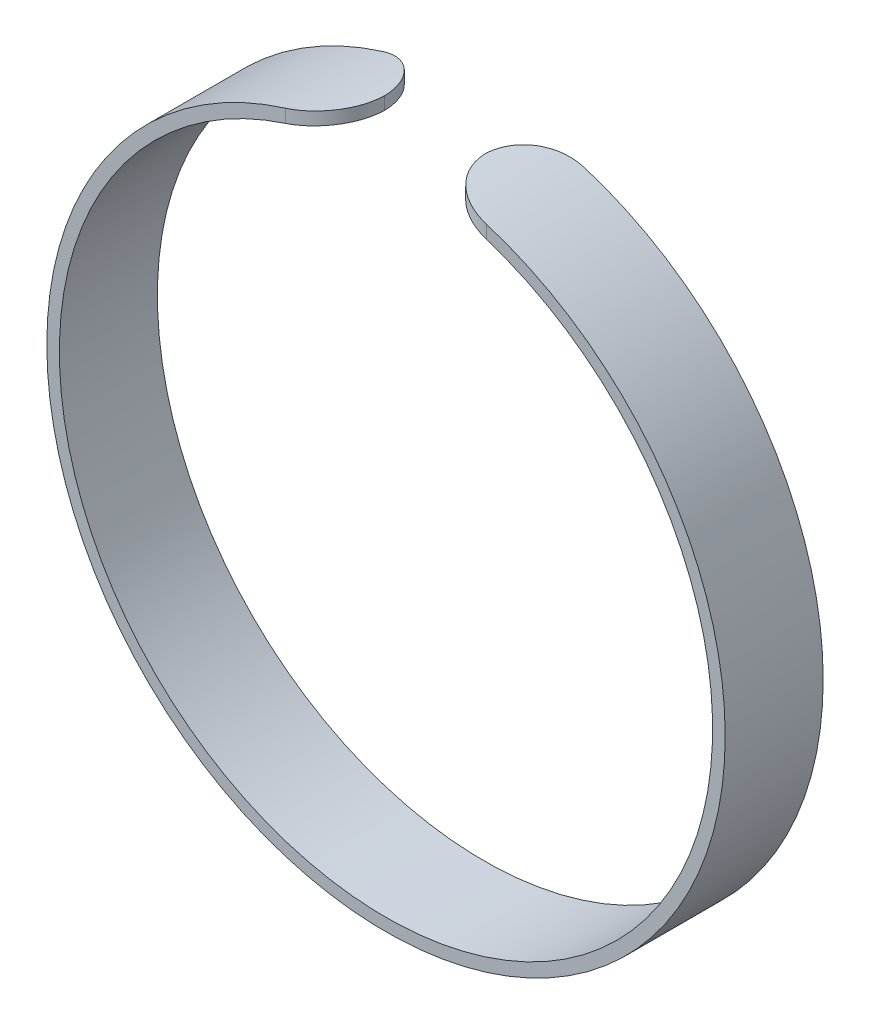
ISO-10303-21;
HEADER;
FILE_DESCRIPTION(('STEP AP214'),'2;1');
FILE_NAME('part.step','',(''),(''),'','','');
FILE_SCHEMA(('AUTOMOTIVE_DESIGN { 1 0 10303 214 1 1 1 1 }'));
ENDSEC;
DATA;
#1=APPLICATION_CONTEXT('core data for automotive mechanical design processes');
#2=APPLICATION_PROTOCOL_DEFINITION('international standard','automotive_design',2000,#1);
#3=PRODUCT_CONTEXT('',#1,'mechanical');
#4=PRODUCT('Part','Part','',(#3));
#5=PRODUCT_RELATED_PRODUCT_CATEGORY('part','',(#4));
#6=PRODUCT_DEFINITION_FORMATION('','',#4);
#7=PRODUCT_DEFINITION_CONTEXT('part definition',#1,'design');
#8=PRODUCT_DEFINITION('design','',#6,#7);
#9=PRODUCT_DEFINITION_SHAPE('','',#8);
#10=(LENGTH_UNIT() NAMED_UNIT(*) SI_UNIT(.MILLI.,.METRE.));
#11=(NAMED_UNIT(*) PLANE_ANGLE_UNIT() SI_UNIT($,.RADIAN.));
#12=(NAMED_UNIT(*) SI_UNIT($,.STERADIAN.) SOLID_ANGLE_UNIT());
#13=UNCERTAINTY_MEASURE_WITH_UNIT(LENGTH_MEASURE(1.E-05),#10,'distance_accuracy_value','');
#14=(GEOMETRIC_REPRESENTATION_CONTEXT(3) GLOBAL_UNCERTAINTY_ASSIGNED_CONTEXT((#13)) GLOBAL_UNIT_ASSIGNED_CONTEXT((#10,
#11,#12)) REPRESENTATION_CONTEXT('',''));
#15=CARTESIAN_POINT('',(0.,0.,0.));
#16=DIRECTION('',(0.,0.,1.));
#17=DIRECTION('',(1.,0.,0.));
#18=AXIS2_PLACEMENT_3D('',#15,#16,#17);
#19=CARTESIAN_POINT('',(0.,0.,7.8));
#20=DIRECTION('',(0.,0.,-1.));
#21=DIRECTION('',(-1.,0.,0.));
#22=AXIS2_PLACEMENT_3D('',#19,#20,#21);
#23=CYLINDRICAL_SURFACE('',#22,26.);
#24=CARTESIAN_POINT('',(7.99999999999999,24.738633753706,7.8));
#25=CARTESIAN_POINT('',(7.88780128889304,24.7749247791275,7.80001059040212));
#26=CARTESIAN_POINT('',(7.77534163963829,24.8104410799334,7.79527944188164));
#27=CARTESIAN_POINT('',(7.55066863119694,24.8797330909779,7.77627861395891));
#28=CARTESIAN_POINT('',(7.43845532665588,24.9135084463271,7.76200699796236));
#29=CARTESIAN_POINT('',(7.21499483830451,24.9791402939498,7.72385399238697));
#30=CARTESIAN_POINT('',(7.10374855274676,25.0109951376633,7.69996447816594));
#31=CARTESIAN_POINT('',(6.88316404283017,25.0725977450881,7.6426112626765));
#32=CARTESIAN_POINT('',(6.77382566352756,25.1023456805103,7.60914834275349));
#33=CARTESIAN_POINT('',(6.5577281441054,25.1596645570077,7.53269459864832));
#34=CARTESIAN_POINT('',(6.45097349713466,25.1872318717162,7.48968833774168));
#35=CARTESIAN_POINT('',(6.24106186273427,25.2400646890394,7.39436066958367));
#36=CARTESIAN_POINT('',(6.13790623821223,25.2653293253728,7.34203577829747));
#37=CARTESIAN_POINT('',(5.93622566779991,25.313473929809,7.22844194763067));
#38=CARTESIAN_POINT('',(5.8376953662074,25.3363566952639,7.16718370771881));
#39=CARTESIAN_POINT('',(5.64594912693324,25.3797739650946,7.03603769829408));
#40=CARTESIAN_POINT('',(5.55273510141379,25.400307627181,6.9661468520569));
#41=CARTESIAN_POINT('',(5.37543012520367,25.4384100362278,6.82065414007161));
#42=CARTESIAN_POINT('',(5.29114047544874,25.45605380485,6.74531391915572));
#43=CARTESIAN_POINT('',(5.12900306791501,25.4892169132343,6.58750405498525));
#44=CARTESIAN_POINT('',(5.05115770131488,25.504735465811,6.50503178835714));
#45=CARTESIAN_POINT('',(4.90260075509351,25.5337078156146,6.3335713839282));
#46=CARTESIAN_POINT('',(4.83188851050611,25.5471618053659,6.24458385483247));
#47=CARTESIAN_POINT('',(4.69815475223753,25.5720936216651,6.06069613889817));
#48=CARTESIAN_POINT('',(4.63513594682483,25.5835707528939,5.96579388759686));
#49=CARTESIAN_POINT('',(4.51862852993752,25.6044024197479,5.77293361168757));
#50=CARTESIAN_POINT('',(4.46496199735855,25.6137978003377,5.67508742304298));
#51=CARTESIAN_POINT('',(4.36594150400212,25.6308618565737,5.47513163966176));
#52=CARTESIAN_POINT('',(4.32058748151032,25.6385305450393,5.3730220765845));
#53=CARTESIAN_POINT('',(4.23857501593894,25.6522165477553,5.16533414213465));
#54=CARTESIAN_POINT('',(4.20191114725008,25.6582348927511,5.05975798222941));
#55=CARTESIAN_POINT('',(4.13753517442944,25.6686940535128,4.84586933780654));
#56=CARTESIAN_POINT('',(4.10982091553704,25.6731352490282,4.73755751872374));
#57=CARTESIAN_POINT('',(4.05789100346867,25.6814024084558,4.49216657746712));
#58=CARTESIAN_POINT('',(4.03619106220021,25.6848118742625,4.35453378037896));
#59=CARTESIAN_POINT('',(4.00723884463647,25.6893376163361,4.0779277299844));
#60=CARTESIAN_POINT('',(3.99996513436462,25.690457294764,3.93895677405664));
#61=CARTESIAN_POINT('',(3.99999999999999,25.6904651573303,3.8));
#62=B_SPLINE_CURVE_WITH_KNOTS('',3,(#24,#25,#26,#27,#28,#29,#30,#31,#32,#33,#34,#35,#36,#37,#38,
#39,#40,#41,#42,#43,#44,#45,#46,#47,#48,#49,#50,#51,#52,#53,#54,#55,#56,#57,#58,#59,#60,#61),
.UNSPECIFIED.,.F.,.F.,(4,2,2,2,2,2,2,2,2,2,2,2,2,2,2,2,2,2,4),(0.,0.35368294352253,
0.707437702020362,1.06149192113039,1.41551725190463,1.770119461602,2.12485452881238,
2.47916816719629,2.83360845193397,3.17645299296719,3.51942418298338,3.86236337082536,
4.20542293520076,4.54099813865348,4.8765708506035,5.21193349598853,5.54721533718753,
5.96454312484224,6.38125039595386),.UNSPECIFIED.);
#63=CARTESIAN_POINT('',(7.99999999999999,24.738633753706,7.8));
#64=VERTEX_POINT('',#63);
#65=CARTESIAN_POINT('',(4.00125019537355,25.6902704710173,3.89999999999999));
#66=VERTEX_POINT('',#65);
#67=EDGE_CURVE('E95',#64,#66,#62,.T.);
#68=ORIENTED_EDGE('',*,*,#67,.T.);
#69=CARTESIAN_POINT('',(4.,25.6904651573302,4.));
#70=CARTESIAN_POINT('',(3.99998729515075,25.6904616899582,3.88878535682253));
#71=CARTESIAN_POINT('',(4.00463772566692,25.6897428934487,3.77757243666818));
#72=CARTESIAN_POINT('',(4.02317320520207,25.6868495556298,3.55594316834291));
#73=CARTESIAN_POINT('',(4.03705779737096,25.6846750863383,3.44552678103757));
#74=CARTESIAN_POINT('',(4.07395422630359,25.6788478067381,3.22636602977801));
#75=CARTESIAN_POINT('',(4.09695826968066,25.6751962586712,3.11762032029352));
#76=CARTESIAN_POINT('',(4.15191334508979,25.666366992627,2.90247848122693));
#77=CARTESIAN_POINT('',(4.18386426537028,25.661189293712,2.79608232231551));
#78=CARTESIAN_POINT('',(4.25647953274379,25.6492443096806,2.58636192647434));
#79=CARTESIAN_POINT('',(4.29714651264747,25.6424765442022,2.48303862850903));
#80=CARTESIAN_POINT('',(4.38688967642551,25.6272758978351,2.28019237776466));
#81=CARTESIAN_POINT('',(4.43596895665909,25.6188424036581,2.18067084087276));
#82=CARTESIAN_POINT('',(4.54211563138057,25.600236045029,1.98622285342621));
#83=CARTESIAN_POINT('',(4.59917875525639,25.5900641098406,1.89129398251943));
#84=CARTESIAN_POINT('',(4.72088840846814,25.5678907756342,1.70660455288267));
#85=CARTESIAN_POINT('',(4.78553772492775,25.5558887037463,1.6168459118355));
#86=CARTESIAN_POINT('',(4.9219430610431,25.52996860323,1.44309316280466));
#87=CARTESIAN_POINT('',(4.99370406593669,25.5160492278834,1.35910316942855));
#88=CARTESIAN_POINT('',(5.14375355046704,25.4862247712014,1.19749745116894));
#89=CARTESIAN_POINT('',(5.22204442659367,25.470318959761,1.11988408746347));
#90=CARTESIAN_POINT('',(5.38449552067398,25.436471455213,0.971597598705601));
#91=CARTESIAN_POINT('',(5.4686538131487,25.4185304287902,0.900922215016373));
#92=CARTESIAN_POINT('',(5.642202408035,25.380572654344,0.766915979974021));
#93=CARTESIAN_POINT('',(5.73159459296637,25.3605551574356,0.703587795974791));
#94=CARTESIAN_POINT('',(6.00814584817664,25.2969957556274,0.524232928340125));
#95=CARTESIAN_POINT('',(6.20239849867831,25.2502084547327,0.420000999656298));
#96=CARTESIAN_POINT('',(6.60341878334278,25.1483137844103,0.245341762686058));
#97=CARTESIAN_POINT('',(6.81018789357836,25.0932054325268,0.174918450247949));
#98=CARTESIAN_POINT('',(7.18146767591195,24.9890884241917,0.0811115351601627));
#99=CARTESIAN_POINT('',(7.34465709493559,24.941629364865,0.0506062363593495));
#100=CARTESIAN_POINT('',(7.67208063803784,24.842882145666,0.0100490101190389));
#101=CARTESIAN_POINT('',(7.83631222245,24.7916013494489,-4.12476647415887E-05));
#102=CARTESIAN_POINT('',(7.99999999999999,24.738633753706,0.));
#103=B_SPLINE_CURVE_WITH_KNOTS('',3,(#69,#70,#71,#72,#73,#74,#75,#76,#77,#78,#79,#80,#81,#82,
#83,#84,#85,#86,#87,#88,#89,#90,#91,#92,#93,#94,#95,#96,#97,#98,#99,#100,#101,#102),
.UNSPECIFIED.,.F.,.F.,(4,2,2,2,2,2,2,2,2,2,2,2,2,2,2,2,4),(0.,0.333541994140305,
0.667067487880818,1.00030856658266,1.33354548309996,1.66688320082325,2.00034387641227,
2.33362685875552,2.66703267300283,3.00067387788298,3.33443807386468,3.66809325113834,
4.00186918323618,4.67461000074208,5.3474303100804,5.86420557592073,6.38000966445057),.UNSPECIFIED.);
#104=CARTESIAN_POINT('',(7.99999999999999,24.738633753706,0.));
#105=VERTEX_POINT('',#104);
#106=EDGE_CURVE('E90',#66,#105,#103,.T.);
#107=ORIENTED_EDGE('',*,*,#106,.T.);
#108=CARTESIAN_POINT('',(0.,0.,0.));
#109=DIRECTION('',(0.,0.,-1.));
#110=DIRECTION('',(1.,0.,0.));
#111=AXIS2_PLACEMENT_3D('',#108,#109,#110);
#112=CIRCLE('',#111,26.);
#113=CARTESIAN_POINT('',(-8.00000000000001,24.738633753706,0.));
#114=VERTEX_POINT('',#113);
#115=EDGE_CURVE('E92',#105,#114,#112,.T.);
#116=ORIENTED_EDGE('',*,*,#115,.T.);
#117=CARTESIAN_POINT('',(-8.00000000000001,24.738633753706,0.));
#118=CARTESIAN_POINT('',(-7.88780128889307,24.7749247791275,-1.05904021225132E-05));
#119=CARTESIAN_POINT('',(-7.77534163963831,24.8104410799334,0.00472055811835463));
#120=CARTESIAN_POINT('',(-7.55066863119696,24.8797330909779,0.0237213860410892));
#121=CARTESIAN_POINT('',(-7.43845532665591,24.9135084463271,0.0379930020376405));
#122=CARTESIAN_POINT('',(-7.21499483830453,24.9791402939498,0.0761460076130332));
#123=CARTESIAN_POINT('',(-7.10374855274678,25.0109951376633,0.100035521834055));
#124=CARTESIAN_POINT('',(-6.88316404283019,25.0725977450881,0.1573887373235));
#125=CARTESIAN_POINT('',(-6.77382566352758,25.1023456805103,0.19085165724651));
#126=CARTESIAN_POINT('',(-6.55772814410542,25.1596645570077,0.267305401351685));
#127=CARTESIAN_POINT('',(-6.45097349713468,25.1872318717162,0.310311662258317));
#128=CARTESIAN_POINT('',(-6.24106186273428,25.2400646890394,0.405639330416335));
#129=CARTESIAN_POINT('',(-6.13790623821224,25.2653293253728,0.457964221702536));
#130=CARTESIAN_POINT('',(-5.93622566779992,25.313473929809,0.57155805236933));
#131=CARTESIAN_POINT('',(-5.83769536620741,25.3363566952639,0.63281629228119));
#132=CARTESIAN_POINT('',(-5.64594912693325,25.3797739650946,0.763962301705925));
#133=CARTESIAN_POINT('',(-5.5527351014138,25.400307627181,0.833853147943102));
#134=CARTESIAN_POINT('',(-5.37543012520368,25.4384100362278,0.979345859928391));
#135=CARTESIAN_POINT('',(-5.29114047544875,25.45605380485,1.05468608084429));
#136=CARTESIAN_POINT('',(-5.12900306791502,25.4892169132343,1.21249594501475));
#137=CARTESIAN_POINT('',(-5.05115770131488,25.504735465811,1.29496821164287));
#138=CARTESIAN_POINT('',(-4.90260075509352,25.5337078156146,1.46642861607181));
#139=CARTESIAN_POINT('',(-4.83188851050611,25.5471618053659,1.55541614516754));
#140=CARTESIAN_POINT('',(-4.69815475223753,25.5720936216651,1.73930386110184));
#141=CARTESIAN_POINT('',(-4.63513594682483,25.5835707528939,1.83420611240315));
#142=CARTESIAN_POINT('',(-4.51862852993752,25.6044024197479,2.02706638831244));
#143=CARTESIAN_POINT('',(-4.46496199735856,25.6137978003377,2.12491257695703));
#144=CARTESIAN_POINT('',(-4.36594150400213,25.6308618565737,2.32486836033825));
#145=CARTESIAN_POINT('',(-4.32058748151032,25.6385305450393,2.42697792341551));
#146=CARTESIAN_POINT('',(-4.23857501593895,25.6522165477553,2.63466585786537));
#147=CARTESIAN_POINT('',(-4.20191114725009,25.6582348927511,2.7402420177706));
#148=CARTESIAN_POINT('',(-4.13753517442945,25.6686940535128,2.95413066219348));
#149=CARTESIAN_POINT('',(-4.10982091553704,25.6731352490282,3.06244248127627));
#150=CARTESIAN_POINT('',(-4.05789100346868,25.6814024084558,3.3078334225329));
#151=CARTESIAN_POINT('',(-4.03619106220022,25.6848118742625,3.44546621962106));
#152=CARTESIAN_POINT('',(-4.00723884463648,25.6893376163361,3.72207227001561));
#153=CARTESIAN_POINT('',(-3.99996513436463,25.690457294764,3.86104322594336));
#154=CARTESIAN_POINT('',(-4.00000000000001,25.6904651573303,4.));
#155=B_SPLINE_CURVE_WITH_KNOTS('',3,(#117,#118,#119,#120,#121,#122,#123,#124,#125,#126,#127,
#128,#129,#130,#131,#132,#133,#134,#135,#136,#137,#138,#139,#140,#141,#142,#143,#144,#145,#146,
#147,#148,#149,#150,#151,#152,#153,#154),.UNSPECIFIED.,.F.,.F.,(4,2,2,2,2,2,2,2,2,2,2,2,2,2,2,2,
2,2,4),(0.,0.353682943522533,0.707437702020366,1.0614919211304,1.41551725190464,
1.77011946160201,2.1248545288124,2.47916816719631,2.83360845193399,3.17645299296721,
3.5194241829834,3.86236337082539,4.20542293520078,4.54099813865351,4.87657085060353,
5.21193349598856,5.54721533718755,5.96454312484226,6.38125039595387),.UNSPECIFIED.);
#156=CARTESIAN_POINT('',(-4.00125019537356,25.6902704710173,3.90000000000012));
#157=VERTEX_POINT('',#156);
#158=EDGE_CURVE('E161',#114,#157,#155,.T.);
#159=ORIENTED_EDGE('',*,*,#158,.T.);
#160=CARTESIAN_POINT('',(-4.,25.6904651573303,3.8));
#161=CARTESIAN_POINT('',(-3.99998729515076,25.6904616899582,3.91121464317747));
#162=CARTESIAN_POINT('',(-4.00463772566693,25.6897428934487,4.02242756333182));
#163=CARTESIAN_POINT('',(-4.02317320520209,25.6868495556298,4.24405683165709));
#164=CARTESIAN_POINT('',(-4.03705779737097,25.6846750863383,4.35447321896243));
#165=CARTESIAN_POINT('',(-4.0739542263036,25.6788478067381,4.57363397022199));
#166=CARTESIAN_POINT('',(-4.09695826968067,25.6751962586712,4.68237967970648));
#167=CARTESIAN_POINT('',(-4.1519133450898,25.666366992627,4.89752151877307));
#168=CARTESIAN_POINT('',(-4.18386426537029,25.661189293712,5.00391767768449));
#169=CARTESIAN_POINT('',(-4.2564795327438,25.6492443096806,5.21363807352566));
#170=CARTESIAN_POINT('',(-4.29714651264748,25.6424765442022,5.31696137149096));
#171=CARTESIAN_POINT('',(-4.38688967642553,25.6272758978351,5.51980762223534));
#172=CARTESIAN_POINT('',(-4.4359689566591,25.6188424036581,5.61932915912724));
#173=CARTESIAN_POINT('',(-4.54211563138058,25.600236045029,5.81377714657379));
#174=CARTESIAN_POINT('',(-4.5991787552564,25.5900641098406,5.90870601748057));
#175=CARTESIAN_POINT('',(-4.72088840846815,25.5678907756341,6.09339544711733));
#176=CARTESIAN_POINT('',(-4.78553772492776,25.5558887037463,6.1831540881645));
#177=CARTESIAN_POINT('',(-4.92194306104311,25.52996860323,6.35690683719534));
#178=CARTESIAN_POINT('',(-4.9937040659367,25.5160492278834,6.44089683057144));
#179=CARTESIAN_POINT('',(-5.14375355046705,25.4862247712014,6.60250254883106));
#180=CARTESIAN_POINT('',(-5.22204442659368,25.470318959761,6.68011591253652));
#181=CARTESIAN_POINT('',(-5.38449552067399,25.436471455213,6.82840240129439));
#182=CARTESIAN_POINT('',(-5.46865381314871,25.4185304287902,6.89907778498362));
#183=CARTESIAN_POINT('',(-5.64220240803501,25.380572654344,7.03308402002597));
#184=CARTESIAN_POINT('',(-5.73159459296638,25.3605551574356,7.0964122040252));
#185=CARTESIAN_POINT('',(-6.00814584817665,25.2969957556273,7.27576707165987));
#186=CARTESIAN_POINT('',(-6.20239849867832,25.2502084547327,7.3799990003437));
#187=CARTESIAN_POINT('',(-6.60341878334279,25.1483137844103,7.55465823731394));
#188=CARTESIAN_POINT('',(-6.81018789357837,25.0932054325268,7.62508154975205));
#189=CARTESIAN_POINT('',(-7.18146767591196,24.9890884241917,7.71888846483983));
#190=CARTESIAN_POINT('',(-7.3446570949356,24.9416293648649,7.74939376364065));
#191=CARTESIAN_POINT('',(-7.67208063803786,24.842882145666,7.78995098988096));
#192=CARTESIAN_POINT('',(-7.83631222245003,24.7916013494489,7.80004124766474));
#193=CARTESIAN_POINT('',(-8.00000000000001,24.738633753706,7.8));
#194=B_SPLINE_CURVE_WITH_KNOTS('',3,(#160,#161,#162,#163,#164,#165,#166,#167,#168,#169,#170,
#171,#172,#173,#174,#175,#176,#177,#178,#179,#180,#181,#182,#183,#184,#185,#186,#187,#188,#189,
#190,#191,#192,#193),.UNSPECIFIED.,.F.,.F.,(4,2,2,2,2,2,2,2,2,2,2,2,2,2,2,2,4),(0.,
0.333541994140304,0.667067487880816,1.00030856658265,1.33354548309996,1.66688320082325,
2.00034387641226,2.33362685875552,2.66703267300283,3.00067387788298,3.33443807386467,
3.66809325113833,4.00186918323618,4.67461000074208,5.3474303100804,5.86420557592073,
6.38000966445058),.UNSPECIFIED.);
#195=CARTESIAN_POINT('',(-8.00000000000001,24.738633753706,7.8));
#196=VERTEX_POINT('',#195);
#197=EDGE_CURVE('E169',#157,#196,#194,.T.);
#198=ORIENTED_EDGE('',*,*,#197,.T.);
#199=CARTESIAN_POINT('',(0.,0.,7.8));
#200=DIRECTION('',(0.,0.,-1.));
#201=DIRECTION('',(1.,0.,0.));
#202=AXIS2_PLACEMENT_3D('',#199,#200,#201);
#203=CIRCLE('',#202,26.);
#204=EDGE_CURVE('E175',#64,#196,#203,.T.);
#205=ORIENTED_EDGE('',*,*,#204,.F.);
#206=EDGE_LOOP('',(#68,#107,#116,#159,#198,#205));
#207=FACE_BOUND('',#206,.T.);
#208=ADVANCED_FACE('F35',(#207),#23,.F.);
#209=CARTESIAN_POINT('',(0.,0.,7.8));
#210=DIRECTION('',(0.,0.,-1.));
#211=DIRECTION('',(-1.,0.,0.));
#212=AXIS2_PLACEMENT_3D('',#209,#210,#211);
#213=CYLINDRICAL_SURFACE('',#212,27.);
#214=CARTESIAN_POINT('',(0.,0.,0.));
#215=DIRECTION('',(0.,0.,1.));
#216=DIRECTION('',(1.,0.,0.));
#217=AXIS2_PLACEMENT_3D('',#214,#215,#216);
#218=CIRCLE('',#217,27.);
#219=CARTESIAN_POINT('',(-8.00000000000001,25.7875939164553,0.));
#220=VERTEX_POINT('',#219);
#221=CARTESIAN_POINT('',(7.99999999999999,25.7875939164553,0.));
#222=VERTEX_POINT('',#221);
#223=EDGE_CURVE('E109',#220,#222,#218,.T.);
#224=ORIENTED_EDGE('',*,*,#223,.T.);
#225=CARTESIAN_POINT('',(7.99999999999999,25.7875939164553,0.));
#226=CARTESIAN_POINT('',(7.88777673581484,25.8224163227939,-1.07056624829766E-05));
#227=CARTESIAN_POINT('',(7.77531327031235,25.8564948960574,0.00472259651644716));
#228=CARTESIAN_POINT('',(7.55067642212848,25.9229801873043,0.0237210875305384));
#229=CARTESIAN_POINT('',(7.43850309677172,25.955386595792,0.037988034149566));
#230=CARTESIAN_POINT('',(7.21517835090967,26.0183531203165,0.0761114865411439));
#231=CARTESIAN_POINT('',(7.10402772722682,26.048911885585,0.0999749128459947));
#232=CARTESIAN_POINT('',(6.88367128347212,26.1080078507981,0.157244919221112));
#233=CARTESIAN_POINT('',(6.77446531540123,26.1365452050798,0.190650769734092));
#234=CARTESIAN_POINT('',(6.55867388690396,26.1915294685546,0.266945534099979));
#235=CARTESIAN_POINT('',(6.45209268631427,26.217973116382,0.309848862392007));
#236=CARTESIAN_POINT('',(6.24254738711562,26.2686548321594,0.404919792116907));
#237=CARTESIAN_POINT('',(6.13958465688199,26.2928920711197,0.457090854062565));
#238=CARTESIAN_POINT('',(5.93829139008893,26.3390840479952,0.570323993027257));
#239=CARTESIAN_POINT('',(5.83995571992083,26.3610413497361,0.631375893698308));
#240=CARTESIAN_POINT('',(5.64859270292504,26.4027080918956,0.76205126795619));
#241=CARTESIAN_POINT('',(5.55556727135004,26.4224167238105,0.831677805940187));
#242=CARTESIAN_POINT('',(5.37838890695321,26.4590413669387,0.976778579222938));
#243=CARTESIAN_POINT('',(5.29405278997933,26.4760237784653,1.05201247189785));
#244=CARTESIAN_POINT('',(5.13182704432345,26.5079457753882,1.209591900288));
#245=CARTESIAN_POINT('',(5.05393981047716,26.5228846032174,1.29194005494049));
#246=CARTESIAN_POINT('',(4.905293639425,26.5507780656627,1.46314436054602));
#247=CARTESIAN_POINT('',(4.83453399576992,26.5637328969886,1.55199986501418));
#248=CARTESIAN_POINT('',(4.70070705971659,26.5877410055563,1.73558124400363));
#249=CARTESIAN_POINT('',(4.63764247905698,26.5987936130149,1.83030917033255));
#250=CARTESIAN_POINT('',(4.4632249083076,26.6288078392456,2.1183006039333));
#251=CARTESIAN_POINT('',(4.36347266236,26.6452057809642,2.3190431710199));
#252=CARTESIAN_POINT('',(4.19887420898984,26.6716416123113,2.73454953721263));
#253=CARTESIAN_POINT('',(4.1340023082623,26.6816841843537,2.94930288468016));
#254=CARTESIAN_POINT('',(4.05841973547492,26.6932589658265,3.30464548947795));
#255=CARTESIAN_POINT('',(4.0365239705433,26.696569835127,3.44288978516845));
#256=CARTESIAN_POINT('',(4.0073160752127,26.7009641693407,3.72073784430977));
#257=CARTESIAN_POINT('',(3.99998238244491,26.7020509276154,3.86033928970323));
#258=CARTESIAN_POINT('',(4.,26.7020598456374,4.));
#259=B_SPLINE_CURVE_WITH_KNOTS('',3,(#225,#226,#227,#228,#229,#230,#231,#232,#233,#234,#235,
#236,#237,#238,#239,#240,#241,#242,#243,#244,#245,#246,#247,#248,#249,#250,#251,#252,#253,#254,
#255,#256,#257,#258),.UNSPECIFIED.,.F.,.F.,(4,2,2,2,2,2,2,2,2,2,2,2,2,2,2,2,4),(0.,
0.352420804401392,0.704906604995578,1.05764705901883,1.4103605518091,1.76361307781188,
2.11699778438003,2.46998069964741,2.82309013175606,3.16552723137753,3.50809093220943,
3.85062064645373,4.19327072160773,4.86409754697814,5.53442955346872,5.95372065588963,
6.37239044073071),.UNSPECIFIED.);
#260=CARTESIAN_POINT('',(4.00125019537356,26.7018725349745,3.9000000000001));
#261=VERTEX_POINT('',#260);
#262=EDGE_CURVE('E53',#222,#261,#259,.T.);
#263=ORIENTED_EDGE('',*,*,#262,.T.);
#264=CARTESIAN_POINT('',(4.,26.7020598456374,3.8));
#265=CARTESIAN_POINT('',(3.99998733789281,26.7020564946756,3.91130891084654));
#266=CARTESIAN_POINT('',(4.00464559390361,26.7013637654338,4.0226160976723));
#267=CARTESIAN_POINT('',(4.02321259103469,26.6985753074059,4.24443328825431));
#268=CARTESIAN_POINT('',(4.03712087551172,26.6964796478778,4.35494333109071));
#269=CARTESIAN_POINT('',(4.07408096047666,26.6908634664914,4.57429085597553));
#270=CARTESIAN_POINT('',(4.09712501858983,26.6873441511,4.68312967343134));
#271=CARTESIAN_POINT('',(4.15217702100288,26.6788344254441,4.89845583483963));
#272=CARTESIAN_POINT('',(4.18418485352564,26.6738440335237,5.00494320809645));
#273=CARTESIAN_POINT('',(4.25693178405723,26.6623308378452,5.21484348451456));
#274=CARTESIAN_POINT('',(4.29767351997068,26.6558075710548,5.31825544803924));
#275=CARTESIAN_POINT('',(4.38758534716948,26.6411555545463,5.52127571569363));
#276=CARTESIAN_POINT('',(4.43675854230151,26.6330262134207,5.62088260250143));
#277=CARTESIAN_POINT('',(4.54311375390101,26.6150901245932,5.81549681381344));
#278=CARTESIAN_POINT('',(4.60029148064079,26.6052842747343,5.91050656552028));
#279=CARTESIAN_POINT('',(4.72225324570232,26.5839078588743,6.09535215555586));
#280=CARTESIAN_POINT('',(4.78704007946914,26.5723366438409,6.18518607419937));
#281=CARTESIAN_POINT('',(4.92374071134311,26.5473464918053,6.35907542200549));
#282=CARTESIAN_POINT('',(4.99565897759694,26.5339263943231,6.44312717182576));
#283=CARTESIAN_POINT('',(5.1460501546037,26.5051699015219,6.60484750794372));
#284=CARTESIAN_POINT('',(5.22452547348117,26.4898328011352,6.68251372814984));
#285=CARTESIAN_POINT('',(5.38737633791065,26.4571929883475,6.83089458812568));
#286=CARTESIAN_POINT('',(5.47175001385809,26.439890897714,6.9016114137032));
#287=CARTESIAN_POINT('',(5.64576207434016,26.4032820292346,7.03568389311682));
#288=CARTESIAN_POINT('',(5.73540235114171,26.3839745289167,7.09903687650416));
#289=CARTESIAN_POINT('',(6.01264379372324,26.3226889917795,7.27836197001227));
#290=CARTESIAN_POINT('',(6.20738144463021,26.2775804481026,7.38252517978326));
#291=CARTESIAN_POINT('',(6.60950116587771,26.1793306341873,7.55694099328585));
#292=CARTESIAN_POINT('',(6.81688410357187,26.1261888125672,7.6271912679397));
#293=CARTESIAN_POINT('',(7.18757647442666,26.0262594185189,7.7201013017579));
#294=CARTESIAN_POINT('',(7.349497810121,25.9810148648807,7.75014147359085));
#295=CARTESIAN_POINT('',(7.67444351502747,25.8869057184074,7.79009210468315));
#296=CARTESIAN_POINT('',(7.83746530207668,25.8380479493853,7.80003955251311));
#297=CARTESIAN_POINT('',(7.99999999999999,25.7875939164553,7.8));
#298=B_SPLINE_CURVE_WITH_KNOTS('',3,(#264,#265,#266,#267,#268,#269,#270,#271,#272,#273,#274,
#275,#276,#277,#278,#279,#280,#281,#282,#283,#284,#285,#286,#287,#288,#289,#290,#291,#292,#293,
#294,#295,#296,#297),.UNSPECIFIED.,.F.,.F.,(4,2,2,2,2,2,2,2,2,2,2,2,2,2,2,2,4),(0.,
0.333824718050021,0.667632957503148,1.00115890421546,1.33468069208727,1.6683033559715,
2.00204910004224,2.33561666549083,2.66930716309067,3.00320806914522,3.33723214628006,
3.67115082357041,4.00519021893795,4.67805742171007,5.35097082918714,5.86213690057522,
6.37236110875203),.UNSPECIFIED.);
#299=CARTESIAN_POINT('',(7.99999999999999,25.7875939164553,7.8));
#300=VERTEX_POINT('',#299);
#301=EDGE_CURVE('E139',#261,#300,#298,.T.);
#302=ORIENTED_EDGE('',*,*,#301,.T.);
#303=CARTESIAN_POINT('',(0.,0.,7.8));
#304=DIRECTION('',(0.,0.,1.));
#305=DIRECTION('',(1.,0.,0.));
#306=AXIS2_PLACEMENT_3D('',#303,#304,#305);
#307=CIRCLE('',#306,27.);
#308=CARTESIAN_POINT('',(-8.00000000000001,25.7875939164553,7.8));
#309=VERTEX_POINT('',#308);
#310=EDGE_CURVE('E174',#309,#300,#307,.T.);
#311=ORIENTED_EDGE('',*,*,#310,.F.);
#312=CARTESIAN_POINT('',(-8.00000000000001,25.7875939164553,7.8));
#313=CARTESIAN_POINT('',(-7.88777673581485,25.8224163227939,7.80001070566248));
#314=CARTESIAN_POINT('',(-7.77531327031236,25.8564948960574,7.79527740348355));
#315=CARTESIAN_POINT('',(-7.55067642212849,25.9229801873043,7.77627891246946));
#316=CARTESIAN_POINT('',(-7.43850309677173,25.955386595792,7.76201196585043));
#317=CARTESIAN_POINT('',(-7.21517835090968,26.0183531203165,7.72388851345886));
#318=CARTESIAN_POINT('',(-7.10402772722682,26.048911885585,7.70002508715401));
#319=CARTESIAN_POINT('',(-6.88367128347212,26.1080078507981,7.64275508077889));
#320=CARTESIAN_POINT('',(-6.77446531540123,26.1365452050798,7.60934923026591));
#321=CARTESIAN_POINT('',(-6.55867388690396,26.1915294685546,7.53305446590002));
#322=CARTESIAN_POINT('',(-6.45209268631427,26.217973116382,7.49015113760799));
#323=CARTESIAN_POINT('',(-6.24254738711562,26.2686548321594,7.39508020788309));
#324=CARTESIAN_POINT('',(-6.13958465688199,26.2928920711197,7.34290914593743));
#325=CARTESIAN_POINT('',(-5.93829139008893,26.3390840479952,7.22967600697274));
#326=CARTESIAN_POINT('',(-5.83995571992082,26.361041349736,7.16862410630169));
#327=CARTESIAN_POINT('',(-5.64859270292504,26.4027080918956,7.03794873204381));
#328=CARTESIAN_POINT('',(-5.55556727135003,26.4224167238105,6.96832219405981));
#329=CARTESIAN_POINT('',(-5.37838890695321,26.4590413669387,6.82322142077706));
#330=CARTESIAN_POINT('',(-5.29405278997933,26.4760237784653,6.74798752810215));
#331=CARTESIAN_POINT('',(-5.13182704432344,26.5079457753882,6.59040809971199));
#332=CARTESIAN_POINT('',(-5.05393981047715,26.5228846032174,6.5080599450595));
#333=CARTESIAN_POINT('',(-4.90529363942499,26.5507780656627,6.33685563945397));
#334=CARTESIAN_POINT('',(-4.83453399576991,26.5637328969886,6.24800013498582));
#335=CARTESIAN_POINT('',(-4.70070705971658,26.5877410055563,6.06441875599636));
#336=CARTESIAN_POINT('',(-4.63764247905697,26.5987936130149,5.96969082966744));
#337=CARTESIAN_POINT('',(-4.46322490830759,26.6288078392456,5.6816993960667));
#338=CARTESIAN_POINT('',(-4.36347266235999,26.6452057809642,5.48095682898009));
#339=CARTESIAN_POINT('',(-4.19887420898984,26.6716416123113,5.06545046278736));
#340=CARTESIAN_POINT('',(-4.13400230826229,26.6816841843537,4.85069711531983));
#341=CARTESIAN_POINT('',(-4.05841973547492,26.6932589658265,4.49535451052204));
#342=CARTESIAN_POINT('',(-4.0365239705433,26.696569835127,4.35711021483155));
#343=CARTESIAN_POINT('',(-4.00731607521269,26.7009641693407,4.07926215569022));
#344=CARTESIAN_POINT('',(-3.9999823824449,26.7020509276154,3.93966071029677));
#345=CARTESIAN_POINT('',(-4.,26.7020598456374,3.8));
#346=B_SPLINE_CURVE_WITH_KNOTS('',3,(#312,#313,#314,#315,#316,#317,#318,#319,#320,#321,#322,
#323,#324,#325,#326,#327,#328,#329,#330,#331,#332,#333,#334,#335,#336,#337,#338,#339,#340,#341,
#342,#343,#344,#345),.UNSPECIFIED.,.F.,.F.,(4,2,2,2,2,2,2,2,2,2,2,2,2,2,2,2,4),(0.,
0.352420804401395,0.704906604995583,1.05764705901884,1.4103605518091,1.7636130778119,
2.11699778438005,2.46998069964743,2.82309013175608,3.16552723137755,3.50809093220945,
3.85062064645375,4.19327072160775,4.86409754697816,5.53442955346874,5.95372065588964,
6.37239044073072),.UNSPECIFIED.);
#347=CARTESIAN_POINT('',(-4.00125019537356,26.7018725349745,3.9));
#348=VERTEX_POINT('',#347);
#349=EDGE_CURVE('E60',#309,#348,#346,.T.);
#350=ORIENTED_EDGE('',*,*,#349,.T.);
#351=CARTESIAN_POINT('',(-4.,26.7020598456374,4.));
#352=CARTESIAN_POINT('',(-3.99998733789281,26.7020564946756,3.88869108915346));
#353=CARTESIAN_POINT('',(-4.00464559390361,26.7013637654338,3.7773839023277));
#354=CARTESIAN_POINT('',(-4.02321259103469,26.6985753074059,3.55556671174569));
#355=CARTESIAN_POINT('',(-4.03712087551172,26.6964796478778,3.44505666890929));
#356=CARTESIAN_POINT('',(-4.07408096047666,26.6908634664914,3.22570914402447));
#357=CARTESIAN_POINT('',(-4.09712501858983,26.6873441511,3.11687032656866));
#358=CARTESIAN_POINT('',(-4.15217702100287,26.6788344254441,2.90154416516038));
#359=CARTESIAN_POINT('',(-4.18418485352564,26.6738440335237,2.79505679190355));
#360=CARTESIAN_POINT('',(-4.25693178405723,26.6623308378452,2.58515651548544));
#361=CARTESIAN_POINT('',(-4.29767351997068,26.6558075710548,2.48174455196077));
#362=CARTESIAN_POINT('',(-4.38758534716948,26.6411555545463,2.27872428430638));
#363=CARTESIAN_POINT('',(-4.43675854230151,26.6330262134207,2.17911739749857));
#364=CARTESIAN_POINT('',(-4.54311375390101,26.6150901245932,1.98450318618657));
#365=CARTESIAN_POINT('',(-4.60029148064079,26.6052842747343,1.88949343447972));
#366=CARTESIAN_POINT('',(-4.72225324570232,26.5839078588743,1.70464784444414));
#367=CARTESIAN_POINT('',(-4.78704007946913,26.5723366438409,1.61481392580063));
#368=CARTESIAN_POINT('',(-4.9237407113431,26.5473464918053,1.44092457799451));
#369=CARTESIAN_POINT('',(-4.99565897759694,26.5339263943231,1.35687282817424));
#370=CARTESIAN_POINT('',(-5.1460501546037,26.5051699015219,1.19515249205628));
#371=CARTESIAN_POINT('',(-5.22452547348116,26.4898328011352,1.11748627185016));
#372=CARTESIAN_POINT('',(-5.38737633791064,26.4571929883475,0.969105411874329));
#373=CARTESIAN_POINT('',(-5.47175001385808,26.439890897714,0.898388586296801));
#374=CARTESIAN_POINT('',(-5.64576207434015,26.4032820292346,0.76431610688318));
#375=CARTESIAN_POINT('',(-5.7354023511417,26.3839745289167,0.700963123495843));
#376=CARTESIAN_POINT('',(-6.01264379372324,26.3226889917795,0.521638029987736));
#377=CARTESIAN_POINT('',(-6.2073814446302,26.2775804481026,0.417474820216746));
#378=CARTESIAN_POINT('',(-6.60950116587771,26.1793306341873,0.243059006714151));
#379=CARTESIAN_POINT('',(-6.81688410357186,26.1261888125672,0.172808732060304));
#380=CARTESIAN_POINT('',(-7.18757647442666,26.0262594185189,0.0798986982420999));
#381=CARTESIAN_POINT('',(-7.349497810121,25.9810148648807,0.0498585264091538));
#382=CARTESIAN_POINT('',(-7.67444351502748,25.8869057184074,0.00990789531685386));
#383=CARTESIAN_POINT('',(-7.83746530207669,25.8380479493853,-3.95525131104083E-05));
#384=CARTESIAN_POINT('',(-8.00000000000001,25.7875939164553,0.));
#385=B_SPLINE_CURVE_WITH_KNOTS('',3,(#351,#352,#353,#354,#355,#356,#357,#358,#359,#360,#361,
#362,#363,#364,#365,#366,#367,#368,#369,#370,#371,#372,#373,#374,#375,#376,#377,#378,#379,#380,
#381,#382,#383,#384),.UNSPECIFIED.,.F.,.F.,(4,2,2,2,2,2,2,2,2,2,2,2,2,2,2,2,4),(0.,
0.33382471805002,0.667632957503147,1.00115890421546,1.33468069208726,1.66830335597149,
2.00204910004224,2.33561666549083,2.66930716309067,3.00320806914521,3.33723214628005,
3.67115082357041,4.00519021893795,4.67805742171007,5.35097082918713,5.86213690057522,
6.37236110875204),.UNSPECIFIED.);
#386=EDGE_CURVE('E114',#348,#220,#385,.T.);
#387=ORIENTED_EDGE('',*,*,#386,.T.);
#388=EDGE_LOOP('',(#224,#263,#302,#311,#350,#387));
#389=FACE_BOUND('',#388,.T.);
#390=ADVANCED_FACE('F126',(#389),#213,.T.);
#391=CARTESIAN_POINT('',(0.,0.,7.8));
#392=DIRECTION('',(0.,0.,1.));
#393=DIRECTION('',(1.,0.,0.));
#394=AXIS2_PLACEMENT_3D('',#391,#392,#393);
#395=PLANE('',#394);
#396=ORIENTED_EDGE('',*,*,#310,.T.);
#397=DIRECTION('',(0.,-1.,0.));
#398=VECTOR('',#397,1.);
#399=CARTESIAN_POINT('',(7.99999999999999,25.6904651573302,7.8));
#400=LINE('',#399,#398);
#401=EDGE_CURVE('E11',#300,#64,#400,.T.);
#402=ORIENTED_EDGE('',*,*,#401,.T.);
#403=ORIENTED_EDGE('',*,*,#204,.T.);
#404=DIRECTION('',(0.,1.,0.));
#405=VECTOR('',#404,1.);
#406=CARTESIAN_POINT('',(-8.,26.7020598456374,7.8));
#407=LINE('',#406,#405);
#408=EDGE_CURVE('E45',#196,#309,#407,.T.);
#409=ORIENTED_EDGE('',*,*,#408,.T.);
#410=EDGE_LOOP('',(#396,#402,#403,#409));
#411=FACE_BOUND('',#410,.T.);
#412=ADVANCED_FACE('F131',(#411),#395,.T.);
#413=CARTESIAN_POINT('',(0.,0.,0.));
#414=DIRECTION('',(0.,0.,1.));
#415=DIRECTION('',(1.,0.,0.));
#416=AXIS2_PLACEMENT_3D('',#413,#414,#415);
#417=PLANE('',#416);
#418=ORIENTED_EDGE('',*,*,#115,.F.);
#419=DIRECTION('',(0.,-1.,0.));
#420=VECTOR('',#419,1.);
#421=CARTESIAN_POINT('',(7.99999999999977,0.,0.));
#422=LINE('',#421,#420);
#423=EDGE_CURVE('E107',#105,#222,#422,.F.);
#424=ORIENTED_EDGE('',*,*,#423,.T.);
#425=ORIENTED_EDGE('',*,*,#223,.F.);
#426=DIRECTION('',(0.,1.,0.));
#427=VECTOR('',#426,1.);
#428=CARTESIAN_POINT('',(-8.00000000000014,0.,0.));
#429=LINE('',#428,#427);
#430=EDGE_CURVE('E100',#220,#114,#429,.F.);
#431=ORIENTED_EDGE('',*,*,#430,.T.);
#432=EDGE_LOOP('',(#418,#424,#425,#431));
#433=FACE_BOUND('',#432,.T.);
#434=ADVANCED_FACE('F105',(#433),#417,.F.);
#435=CARTESIAN_POINT('',(7.99999999999977,0.,3.8));
#436=DIRECTION('',(0.,1.,0.));
#437=DIRECTION('',(-1.,0.,0.));
#438=AXIS2_PLACEMENT_3D('',#435,#436,#437);
#439=CYLINDRICAL_SURFACE('',#438,4.);
#440=ORIENTED_EDGE('',*,*,#401,.F.);
#441=ORIENTED_EDGE('',*,*,#301,.F.);
#442=DIRECTION('',(0.,1.,0.));
#443=VECTOR('',#442,1.);
#444=CARTESIAN_POINT('',(4.00125019537355,25.7203467996717,3.9));
#445=LINE('',#444,#443);
#446=EDGE_CURVE('E110',#66,#261,#445,.T.);
#447=ORIENTED_EDGE('',*,*,#446,.F.);
#448=ORIENTED_EDGE('',*,*,#67,.F.);
#449=EDGE_LOOP('',(#440,#441,#447,#448));
#450=FACE_BOUND('',#449,.T.);
#451=ADVANCED_FACE('F148',(#450),#439,.T.);
#452=CARTESIAN_POINT('',(8.,26.7020598456373,4.));
#453=DIRECTION('',(0.,-1.,0.));
#454=DIRECTION('',(1.,0.,0.));
#455=AXIS2_PLACEMENT_3D('',#452,#453,#454);
#456=CYLINDRICAL_SURFACE('',#455,4.);
#457=ORIENTED_EDGE('',*,*,#262,.F.);
#458=ORIENTED_EDGE('',*,*,#423,.F.);
#459=ORIENTED_EDGE('',*,*,#106,.F.);
#460=ORIENTED_EDGE('',*,*,#446,.T.);
#461=EDGE_LOOP('',(#457,#458,#459,#460));
#462=FACE_BOUND('',#461,.T.);
#463=ADVANCED_FACE('F112',(#462),#456,.T.);
#464=CARTESIAN_POINT('',(-8.00000000000014,0.,3.8));
#465=DIRECTION('',(0.,-1.,0.));
#466=DIRECTION('',(1.,0.,0.));
#467=AXIS2_PLACEMENT_3D('',#464,#465,#466);
#468=CYLINDRICAL_SURFACE('',#467,4.);
#469=ORIENTED_EDGE('',*,*,#408,.F.);
#470=ORIENTED_EDGE('',*,*,#197,.F.);
#471=DIRECTION('',(0.,-1.,0.));
#472=VECTOR('',#471,1.);
#473=CARTESIAN_POINT('',(-4.00125019537356,25.7203467996717,3.9));
#474=LINE('',#473,#472);
#475=EDGE_CURVE('E40',#348,#157,#474,.T.);
#476=ORIENTED_EDGE('',*,*,#475,.F.);
#477=ORIENTED_EDGE('',*,*,#349,.F.);
#478=EDGE_LOOP('',(#469,#470,#476,#477));
#479=FACE_BOUND('',#478,.T.);
#480=ADVANCED_FACE('F37',(#479),#468,.T.);
#481=CARTESIAN_POINT('',(-8.,26.7020598456374,4.));
#482=DIRECTION('',(0.,1.,0.));
#483=DIRECTION('',(-1.,0.,0.));
#484=AXIS2_PLACEMENT_3D('',#481,#482,#483);
#485=CYLINDRICAL_SURFACE('',#484,4.);
#486=ORIENTED_EDGE('',*,*,#158,.F.);
#487=ORIENTED_EDGE('',*,*,#430,.F.);
#488=ORIENTED_EDGE('',*,*,#386,.F.);
#489=ORIENTED_EDGE('',*,*,#475,.T.);
#490=EDGE_LOOP('',(#486,#487,#488,#489));
#491=FACE_BOUND('',#490,.T.);
#492=ADVANCED_FACE('F153',(#491),#485,.T.);
#493=CLOSED_SHELL('',(#208,#390,#412,#434,#451,#463,#480,#492));
#494=MANIFOLD_SOLID_BREP('B2',#493);
#495=ADVANCED_BREP_SHAPE_REPRESENTATION('',(#18,#494),#14);
#496=SHAPE_DEFINITION_REPRESENTATION(#9,#495);
ENDSEC;
END-ISO-10303-21;
